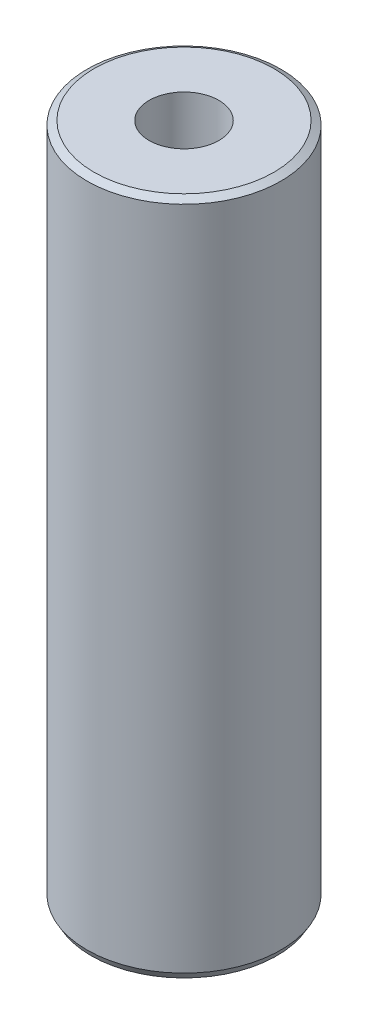
ISO-10303-21;
HEADER;
FILE_DESCRIPTION(('STEP AP214'),'2;1');
FILE_NAME('part.step','',(''),(''),'','','');
FILE_SCHEMA(('AUTOMOTIVE_DESIGN { 1 0 10303 214 1 1 1 1 }'));
ENDSEC;
DATA;
#1=APPLICATION_CONTEXT('core data for automotive mechanical design processes');
#2=APPLICATION_PROTOCOL_DEFINITION('international standard','automotive_design',2000,#1);
#3=PRODUCT_CONTEXT('',#1,'mechanical');
#4=PRODUCT('Part','Part','',(#3));
#5=PRODUCT_RELATED_PRODUCT_CATEGORY('part','',(#4));
#6=PRODUCT_DEFINITION_FORMATION('','',#4);
#7=PRODUCT_DEFINITION_CONTEXT('part definition',#1,'design');
#8=PRODUCT_DEFINITION('design','',#6,#7);
#9=PRODUCT_DEFINITION_SHAPE('','',#8);
#10=(LENGTH_UNIT() NAMED_UNIT(*) SI_UNIT(.MILLI.,.METRE.));
#11=(NAMED_UNIT(*) PLANE_ANGLE_UNIT() SI_UNIT($,.RADIAN.));
#12=(NAMED_UNIT(*) SI_UNIT($,.STERADIAN.) SOLID_ANGLE_UNIT());
#13=UNCERTAINTY_MEASURE_WITH_UNIT(LENGTH_MEASURE(1.E-05),#10,'distance_accuracy_value','');
#14=(GEOMETRIC_REPRESENTATION_CONTEXT(3) GLOBAL_UNCERTAINTY_ASSIGNED_CONTEXT((#13)) GLOBAL_UNIT_ASSIGNED_CONTEXT((#10,
#11,#12)) REPRESENTATION_CONTEXT('',''));
#15=CARTESIAN_POINT('',(0.,0.,0.));
#16=DIRECTION('',(0.,0.,1.));
#17=DIRECTION('',(1.,0.,0.));
#18=AXIS2_PLACEMENT_3D('',#15,#16,#17);
#19=CARTESIAN_POINT('',(0.,122.192010858157,0.));
#20=DIRECTION('',(0.,-1.,0.));
#21=DIRECTION('',(0.,0.,-1.));
#22=AXIS2_PLACEMENT_3D('',#19,#20,#21);
#23=CYLINDRICAL_SURFACE('',#22,17.5);
#24=CARTESIAN_POINT('',(0.,121.454682609,0.));
#25=DIRECTION('',(0.,1.,0.));
#26=DIRECTION('',(0.,0.,1.));
#27=AXIS2_PLACEMENT_3D('',#24,#25,#26);
#28=CIRCLE('',#27,17.5);
#29=CARTESIAN_POINT('',(0.,121.454682609,17.5));
#30=VERTEX_POINT('',#29);
#31=EDGE_CURVE('E50',#30,#30,#28,.F.);
#32=ORIENTED_EDGE('',*,*,#31,.T.);
#33=EDGE_LOOP('',(#32));
#34=FACE_BOUND('',#33,.T.);
#35=CARTESIAN_POINT('',(0.,1.27708998939591,0.));
#36=DIRECTION('',(0.,1.,0.));
#37=DIRECTION('',(0.,0.,1.));
#38=AXIS2_PLACEMENT_3D('',#35,#36,#37);
#39=CIRCLE('',#38,17.5);
#40=CARTESIAN_POINT('',(0.,1.27708998939591,17.5));
#41=VERTEX_POINT('',#40);
#42=EDGE_CURVE('E51',#41,#41,#39,.T.);
#43=ORIENTED_EDGE('',*,*,#42,.T.);
#44=EDGE_LOOP('',(#43));
#45=FACE_BOUND('',#44,.T.);
#46=ADVANCED_FACE('F39',(#34,#45),#23,.T.);
#47=CARTESIAN_POINT('',(0.,122.192010858157,0.));
#48=DIRECTION('',(0.,1.,0.));
#49=DIRECTION('',(0.,0.,1.));
#50=AXIS2_PLACEMENT_3D('',#47,#48,#49);
#51=PLANE('',#50);
#52=CARTESIAN_POINT('',(0.,122.192010858157,0.));
#53=DIRECTION('',(0.,1.,0.));
#54=DIRECTION('',(0.,0.,1.));
#55=AXIS2_PLACEMENT_3D('',#52,#53,#54);
#56=CIRCLE('',#55,16.2229100106041);
#57=CARTESIAN_POINT('',(0.,122.192010858157,16.2229100106041));
#58=VERTEX_POINT('',#57);
#59=EDGE_CURVE('E54',#58,#58,#56,.T.);
#60=ORIENTED_EDGE('',*,*,#59,.T.);
#61=EDGE_LOOP('',(#60));
#62=FACE_BOUND('',#61,.T.);
#63=CARTESIAN_POINT('',(0.,122.192010858157,0.));
#64=DIRECTION('',(0.,1.,0.));
#65=DIRECTION('',(0.,0.,1.));
#66=AXIS2_PLACEMENT_3D('',#63,#64,#65);
#67=CIRCLE('',#66,6.29053206730081);
#68=CARTESIAN_POINT('',(0.,122.192010858157,6.29053206730081));
#69=VERTEX_POINT('',#68);
#70=EDGE_CURVE('E58',#69,#69,#67,.T.);
#71=ORIENTED_EDGE('',*,*,#70,.F.);
#72=EDGE_LOOP('',(#71));
#73=FACE_BOUND('',#72,.T.);
#74=ADVANCED_FACE('F69',(#62,#73),#51,.T.);
#75=CARTESIAN_POINT('',(0.,0.,0.));
#76=DIRECTION('',(0.,1.,0.));
#77=DIRECTION('',(0.,0.,1.));
#78=AXIS2_PLACEMENT_3D('',#75,#76,#77);
#79=PLANE('',#78);
#80=CARTESIAN_POINT('',(0.,0.,0.));
#81=DIRECTION('',(0.,1.,0.));
#82=DIRECTION('',(0.,0.,1.));
#83=AXIS2_PLACEMENT_3D('',#80,#81,#82);
#84=CIRCLE('',#83,16.7626717508429);
#85=CARTESIAN_POINT('',(0.,0.,16.7626717508429));
#86=VERTEX_POINT('',#85);
#87=EDGE_CURVE('E10',#86,#86,#84,.F.);
#88=ORIENTED_EDGE('',*,*,#87,.T.);
#89=EDGE_LOOP('',(#88));
#90=FACE_BOUND('',#89,.T.);
#91=CARTESIAN_POINT('',(0.,0.,0.));
#92=DIRECTION('',(0.,1.,0.));
#93=DIRECTION('',(0.,0.,1.));
#94=AXIS2_PLACEMENT_3D('',#91,#92,#93);
#95=CIRCLE('',#94,6.29053206730081);
#96=CARTESIAN_POINT('',(0.,0.,6.29053206730081));
#97=VERTEX_POINT('',#96);
#98=EDGE_CURVE('E63',#97,#97,#95,.T.);
#99=ORIENTED_EDGE('',*,*,#98,.T.);
#100=EDGE_LOOP('',(#99));
#101=FACE_BOUND('',#100,.T.);
#102=ADVANCED_FACE('F75',(#90,#101),#79,.F.);
#103=CARTESIAN_POINT('',(0.,122.192010858157,0.));
#104=DIRECTION('',(0.,-1.,0.));
#105=DIRECTION('',(0.,0.,-1.));
#106=AXIS2_PLACEMENT_3D('',#103,#104,#105);
#107=CYLINDRICAL_SURFACE('',#106,6.29053206730081);
#108=ORIENTED_EDGE('',*,*,#70,.T.);
#109=EDGE_LOOP('',(#108));
#110=FACE_BOUND('',#109,.T.);
#111=ORIENTED_EDGE('',*,*,#98,.F.);
#112=EDGE_LOOP('',(#111));
#113=FACE_BOUND('',#112,.T.);
#114=ADVANCED_FACE('F70',(#110,#113),#107,.F.);
#115=CARTESIAN_POINT('',(0.,122.192010858157,0.));
#116=DIRECTION('',(0.,-1.,0.));
#117=DIRECTION('',(0.,0.,-1.));
#118=AXIS2_PLACEMENT_3D('',#115,#116,#117);
#119=CONICAL_SURFACE('',#118,16.2229100106041,1.04719755119659);
#120=ORIENTED_EDGE('',*,*,#31,.F.);
#121=EDGE_LOOP('',(#120));
#122=FACE_BOUND('',#121,.T.);
#123=ORIENTED_EDGE('',*,*,#59,.F.);
#124=EDGE_LOOP('',(#123));
#125=FACE_BOUND('',#124,.T.);
#126=ADVANCED_FACE('F81',(#122,#125),#119,.T.);
#127=CARTESIAN_POINT('',(0.,1.27708998939591,0.));
#128=DIRECTION('',(0.,1.,0.));
#129=DIRECTION('',(0.,0.,1.));
#130=AXIS2_PLACEMENT_3D('',#127,#128,#129);
#131=CONICAL_SURFACE('',#130,17.5,0.523598775598295);
#132=ORIENTED_EDGE('',*,*,#87,.F.);
#133=EDGE_LOOP('',(#132));
#134=FACE_BOUND('',#133,.T.);
#135=ORIENTED_EDGE('',*,*,#42,.F.);
#136=EDGE_LOOP('',(#135));
#137=FACE_BOUND('',#136,.T.);
#138=ADVANCED_FACE('F45',(#134,#137),#131,.T.);
#139=CLOSED_SHELL('',(#46,#74,#102,#114,#126,#138));
#140=MANIFOLD_SOLID_BREP('B2',#139);
#141=ADVANCED_BREP_SHAPE_REPRESENTATION('',(#18,#140),#14);
#142=SHAPE_DEFINITION_REPRESENTATION(#9,#141);
ENDSEC;
END-ISO-10303-21;
